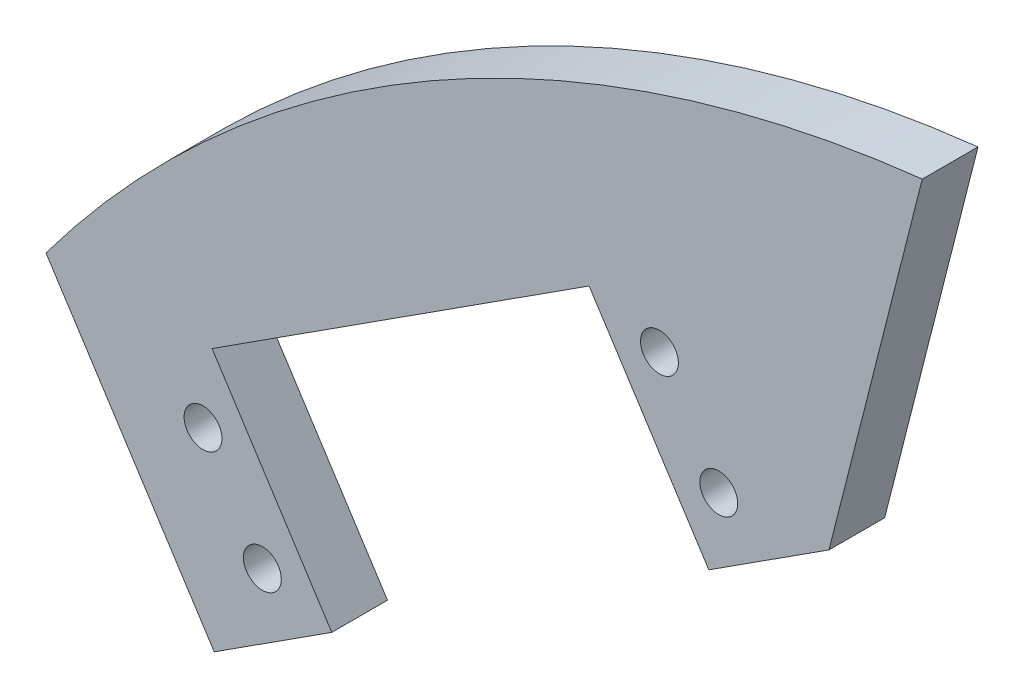
ISO-10303-21;
HEADER;
FILE_DESCRIPTION(('STEP AP214'),'2;1');
FILE_NAME('part.step','',(''),(''),'','','');
FILE_SCHEMA(('AUTOMOTIVE_DESIGN { 1 0 10303 214 1 1 1 1 }'));
ENDSEC;
DATA;
#1=APPLICATION_CONTEXT('core data for automotive mechanical design processes');
#2=APPLICATION_PROTOCOL_DEFINITION('international standard','automotive_design',2000,#1);
#3=PRODUCT_CONTEXT('',#1,'mechanical');
#4=PRODUCT('Part','Part','',(#3));
#5=PRODUCT_RELATED_PRODUCT_CATEGORY('part','',(#4));
#6=PRODUCT_DEFINITION_FORMATION('','',#4);
#7=PRODUCT_DEFINITION_CONTEXT('part definition',#1,'design');
#8=PRODUCT_DEFINITION('design','',#6,#7);
#9=PRODUCT_DEFINITION_SHAPE('','',#8);
#10=(LENGTH_UNIT() NAMED_UNIT(*) SI_UNIT(.MILLI.,.METRE.));
#11=(NAMED_UNIT(*) PLANE_ANGLE_UNIT() SI_UNIT($,.RADIAN.));
#12=(NAMED_UNIT(*) SI_UNIT($,.STERADIAN.) SOLID_ANGLE_UNIT());
#13=UNCERTAINTY_MEASURE_WITH_UNIT(LENGTH_MEASURE(1.E-05),#10,'distance_accuracy_value','');
#14=(GEOMETRIC_REPRESENTATION_CONTEXT(3) GLOBAL_UNCERTAINTY_ASSIGNED_CONTEXT((#13)) GLOBAL_UNIT_ASSIGNED_CONTEXT((#10,
#11,#12)) REPRESENTATION_CONTEXT('',''));
#15=CARTESIAN_POINT('',(0.,0.,0.));
#16=DIRECTION('',(0.,0.,1.));
#17=DIRECTION('',(1.,0.,0.));
#18=AXIS2_PLACEMENT_3D('',#15,#16,#17);
#19=CARTESIAN_POINT('',(0.,0.,5.08));
#20=DIRECTION('',(-0.541224138228905,0.84087836944375,0.));
#21=DIRECTION('',(-0.84087836944375,-0.541224138228905,0.));
#22=AXIS2_PLACEMENT_3D('',#19,#20,#21);
#23=PLANE('',#22);
#24=DIRECTION('',(0.84087836944375,0.541224138228905,0.));
#25=VECTOR('',#24,1.);
#26=CARTESIAN_POINT('',(0.,0.,0.));
#27=LINE('',#26,#25);
#28=CARTESIAN_POINT('',(0.,0.,0.));
#29=VERTEX_POINT('',#28);
#30=CARTESIAN_POINT('',(10.7188199232245,6.89907635466426,0.));
#31=VERTEX_POINT('',#30);
#32=EDGE_CURVE('E142',#29,#31,#27,.T.);
#33=ORIENTED_EDGE('',*,*,#32,.T.);
#34=DIRECTION('',(0.,0.,1.));
#35=VECTOR('',#34,1.);
#36=CARTESIAN_POINT('',(10.7188199232245,6.89907635466426,5.08));
#37=LINE('',#36,#35);
#38=CARTESIAN_POINT('',(10.7188199232245,6.89907635466426,5.08));
#39=VERTEX_POINT('',#38);
#40=EDGE_CURVE('E130',#31,#39,#37,.T.);
#41=ORIENTED_EDGE('',*,*,#40,.T.);
#42=DIRECTION('',(0.84087836944375,0.541224138228905,0.));
#43=VECTOR('',#42,1.);
#44=CARTESIAN_POINT('',(0.,0.,5.08));
#45=LINE('',#44,#43);
#46=CARTESIAN_POINT('',(0.,0.,5.08));
#47=VERTEX_POINT('',#46);
#48=EDGE_CURVE('E134',#47,#39,#45,.T.);
#49=ORIENTED_EDGE('',*,*,#48,.F.);
#50=DIRECTION('',(0.,0.,-1.));
#51=VECTOR('',#50,1.);
#52=CARTESIAN_POINT('',(0.,0.,5.08));
#53=LINE('',#52,#51);
#54=EDGE_CURVE('E141',#47,#29,#53,.T.);
#55=ORIENTED_EDGE('',*,*,#54,.T.);
#56=EDGE_LOOP('',(#33,#41,#49,#55));
#57=FACE_BOUND('',#56,.T.);
#58=ADVANCED_FACE('F33',(#57),#23,.F.);
#59=CARTESIAN_POINT('',(45.1056999632572,29.0318962633971,5.08));
#60=VERTEX_POINT('',#59);
#61=CARTESIAN_POINT('',(56.065565282662,36.0861194164122,5.08));
#62=VERTEX_POINT('',#61);
#63=EDGE_CURVE('E85',#60,#62,#45,.T.);
#64=ORIENTED_EDGE('',*,*,#63,.F.);
#65=DIRECTION('',(0.,0.,-1.));
#66=VECTOR('',#65,1.);
#67=CARTESIAN_POINT('',(45.1056999632572,29.0318962633971,5.08));
#68=LINE('',#67,#66);
#69=CARTESIAN_POINT('',(45.1056999632572,29.0318962633971,0.));
#70=VERTEX_POINT('',#69);
#71=EDGE_CURVE('E108',#60,#70,#68,.T.);
#72=ORIENTED_EDGE('',*,*,#71,.T.);
#73=CARTESIAN_POINT('',(56.065565282662,36.0861194164122,0.));
#74=VERTEX_POINT('',#73);
#75=EDGE_CURVE('E133',#70,#74,#27,.T.);
#76=ORIENTED_EDGE('',*,*,#75,.T.);
#77=DIRECTION('',(0.,0.,-1.));
#78=VECTOR('',#77,1.);
#79=CARTESIAN_POINT('',(56.065565282662,36.0861194164122,5.08));
#80=LINE('',#79,#78);
#81=EDGE_CURVE('E41',#62,#74,#80,.T.);
#82=ORIENTED_EDGE('',*,*,#81,.F.);
#83=EDGE_LOOP('',(#64,#72,#76,#82));
#84=FACE_BOUND('',#83,.T.);
#85=ADVANCED_FACE('F35',(#84),#23,.F.);
#86=CARTESIAN_POINT('',(56.065565282662,36.0861194164122,5.08));
#87=DIRECTION('',(-0.969303945872021,0.245865533405824,0.));
#88=DIRECTION('',(-0.245865533405824,-0.969303945872021,0.));
#89=AXIS2_PLACEMENT_3D('',#86,#87,#88);
#90=PLANE('',#89);
#91=DIRECTION('',(0.245865533405824,0.969303945872021,0.));
#92=VECTOR('',#91,1.);
#93=CARTESIAN_POINT('',(56.065565282662,36.0861194164122,0.));
#94=LINE('',#93,#92);
#95=CARTESIAN_POINT('',(64.5737650869772,69.6289732208849,0.));
#96=VERTEX_POINT('',#95);
#97=EDGE_CURVE('E145',#74,#96,#94,.T.);
#98=ORIENTED_EDGE('',*,*,#97,.T.);
#99=DIRECTION('',(0.,0.,-1.));
#100=VECTOR('',#99,1.);
#101=CARTESIAN_POINT('',(64.5737650869772,69.6289732208849,5.08));
#102=LINE('',#101,#100);
#103=CARTESIAN_POINT('',(64.5737650869772,69.6289732208849,5.08));
#104=VERTEX_POINT('',#103);
#105=EDGE_CURVE('E153',#104,#96,#102,.T.);
#106=ORIENTED_EDGE('',*,*,#105,.F.);
#107=DIRECTION('',(0.245865533405824,0.969303945872021,0.));
#108=VECTOR('',#107,1.);
#109=CARTESIAN_POINT('',(56.065565282662,36.0861194164122,5.08));
#110=LINE('',#109,#108);
#111=EDGE_CURVE('E136',#62,#104,#110,.T.);
#112=ORIENTED_EDGE('',*,*,#111,.F.);
#113=ORIENTED_EDGE('',*,*,#81,.T.);
#114=EDGE_LOOP('',(#98,#106,#112,#113));
#115=FACE_BOUND('',#114,.T.);
#116=ADVANCED_FACE('F158',(#115),#90,.F.);
#117=CARTESIAN_POINT('',(77.2788563803177,-45.1795211339497,5.08));
#118=DIRECTION('',(0.,0.,-1.));
#119=DIRECTION('',(-1.,0.,0.));
#120=AXIS2_PLACEMENT_3D('',#117,#118,#119);
#121=CYLINDRICAL_SURFACE('',#120,115.5093490623);
#122=CARTESIAN_POINT('',(77.2788563803177,-45.1795211339497,0.));
#123=DIRECTION('',(0.,0.,1.));
#124=DIRECTION('',(1.,0.,0.));
#125=AXIS2_PLACEMENT_3D('',#122,#123,#124);
#126=CIRCLE('',#125,115.5093490623);
#127=CARTESIAN_POINT('',(-15.3435248614539,23.8386229580216,0.));
#128=VERTEX_POINT('',#127);
#129=EDGE_CURVE('E147',#96,#128,#126,.T.);
#130=ORIENTED_EDGE('',*,*,#129,.T.);
#131=DIRECTION('',(0.,0.,-1.));
#132=VECTOR('',#131,1.);
#133=CARTESIAN_POINT('',(-15.3435248614539,23.8386229580216,5.08));
#134=LINE('',#133,#132);
#135=CARTESIAN_POINT('',(-15.3435248614539,23.8386229580216,5.08));
#136=VERTEX_POINT('',#135);
#137=EDGE_CURVE('E151',#136,#128,#134,.T.);
#138=ORIENTED_EDGE('',*,*,#137,.F.);
#139=CARTESIAN_POINT('',(77.2788563803177,-45.1795211339497,5.08));
#140=DIRECTION('',(0.,0.,1.));
#141=DIRECTION('',(1.,0.,0.));
#142=AXIS2_PLACEMENT_3D('',#139,#140,#141);
#143=CIRCLE('',#142,115.5093490623);
#144=EDGE_CURVE('E138',#104,#136,#143,.T.);
#145=ORIENTED_EDGE('',*,*,#144,.F.);
#146=ORIENTED_EDGE('',*,*,#105,.T.);
#147=EDGE_LOOP('',(#130,#138,#145,#146));
#148=FACE_BOUND('',#147,.T.);
#149=ADVANCED_FACE('F169',(#148),#121,.T.);
#150=CARTESIAN_POINT('',(-15.3435248614539,23.8386229580216,5.08));
#151=DIRECTION('',(0.840878369443749,0.541224138228905,0.));
#152=DIRECTION('',(-0.541224138228905,0.84087836944375,0.));
#153=AXIS2_PLACEMENT_3D('',#150,#151,#152);
#154=PLANE('',#153);
#155=DIRECTION('',(0.541224138228905,-0.84087836944375,0.));
#156=VECTOR('',#155,1.);
#157=CARTESIAN_POINT('',(-15.3435248614539,23.8386229580216,0.));
#158=LINE('',#157,#156);
#159=EDGE_CURVE('E78',#128,#29,#158,.T.);
#160=ORIENTED_EDGE('',*,*,#159,.T.);
#161=ORIENTED_EDGE('',*,*,#54,.F.);
#162=DIRECTION('',(0.541224138228905,-0.84087836944375,0.));
#163=VECTOR('',#162,1.);
#164=CARTESIAN_POINT('',(-15.3435248614539,23.8386229580216,5.08));
#165=LINE('',#164,#163);
#166=EDGE_CURVE('E57',#136,#47,#165,.T.);
#167=ORIENTED_EDGE('',*,*,#166,.F.);
#168=ORIENTED_EDGE('',*,*,#137,.T.);
#169=EDGE_LOOP('',(#160,#161,#167,#168));
#170=FACE_BOUND('',#169,.T.);
#171=ADVANCED_FACE('F171',(#170),#154,.F.);
#172=CARTESIAN_POINT('',(77.2788563803177,-45.1795211339497,5.08));
#173=DIRECTION('',(0.,0.,1.));
#174=DIRECTION('',(1.,0.,0.));
#175=AXIS2_PLACEMENT_3D('',#172,#173,#174);
#176=PLANE('',#175);
#177=CARTESIAN_POINT('',(46.0123874549428,35.5737074102218,5.08));
#178=DIRECTION('',(0.,0.,1.));
#179=DIRECTION('',(1.,0.,0.));
#180=AXIS2_PLACEMENT_3D('',#177,#178,#179);
#181=CIRCLE('',#180,1.72720000000001);
#182=CARTESIAN_POINT('',(47.7395874549428,35.5737074102218,5.08));
#183=VERTEX_POINT('',#182);
#184=EDGE_CURVE('E181',#183,#183,#181,.T.);
#185=ORIENTED_EDGE('',*,*,#184,.F.);
#186=EDGE_LOOP('',(#185));
#187=FACE_BOUND('',#186,.T.);
#188=CARTESIAN_POINT('',(-1.02333321481187,17.1918962623283,5.08));
#189=DIRECTION('',(0.,0.,1.));
#190=DIRECTION('',(1.,0.,0.));
#191=AXIS2_PLACEMENT_3D('',#188,#189,#190);
#192=CIRCLE('',#191,1.7272);
#193=CARTESIAN_POINT('',(0.70386678518813,17.1918962623283,5.08));
#194=VERTEX_POINT('',#193);
#195=EDGE_CURVE('E190',#194,#194,#192,.T.);
#196=ORIENTED_EDGE('',*,*,#195,.F.);
#197=EDGE_LOOP('',(#196));
#198=FACE_BOUND('',#197,.T.);
#199=CARTESIAN_POINT('',(4.38890816747716,8.78311256789089,5.08));
#200=DIRECTION('',(0.,0.,1.));
#201=DIRECTION('',(1.,0.,0.));
#202=AXIS2_PLACEMENT_3D('',#199,#200,#201);
#203=CIRCLE('',#202,1.72720000000001);
#204=CARTESIAN_POINT('',(6.11610816747717,8.78311256789089,5.08));
#205=VERTEX_POINT('',#204);
#206=EDGE_CURVE('E210',#205,#205,#203,.T.);
#207=ORIENTED_EDGE('',*,*,#206,.F.);
#208=EDGE_LOOP('',(#207));
#209=FACE_BOUND('',#208,.T.);
#210=CARTESIAN_POINT('',(40.6001460726538,43.9824911046592,5.08));
#211=DIRECTION('',(0.,0.,1.));
#212=DIRECTION('',(1.,0.,0.));
#213=AXIS2_PLACEMENT_3D('',#210,#211,#212);
#214=CIRCLE('',#213,1.72719999999991);
#215=CARTESIAN_POINT('',(42.3273460726537,43.9824911046592,5.08));
#216=VERTEX_POINT('',#215);
#217=EDGE_CURVE('E211',#216,#216,#214,.T.);
#218=ORIENTED_EDGE('',*,*,#217,.F.);
#219=EDGE_LOOP('',(#218));
#220=FACE_BOUND('',#219,.T.);
#221=DIRECTION('',(0.541224138228905,-0.84087836944375,0.));
#222=VECTOR('',#221,1.);
#223=CARTESIAN_POINT('',(10.7999243444548,6.77306764836013,5.08));
#224=LINE('',#223,#222);
#225=CARTESIAN_POINT('',(-0.197750144356549,23.8597161154571,5.08));
#226=VERTEX_POINT('',#225);
#227=EDGE_CURVE('E111',#226,#39,#224,.T.);
#228=ORIENTED_EDGE('',*,*,#227,.F.);
#229=DIRECTION('',(-0.84087836944375,-0.541224138228904,0.));
#230=VECTOR('',#229,1.);
#231=CARTESIAN_POINT('',(-0.197750144356549,23.8597161154571,5.08));
#232=LINE('',#231,#230);
#233=CARTESIAN_POINT('',(34.1891298956762,45.99253602419,5.08));
#234=VERTEX_POINT('',#233);
#235=EDGE_CURVE('E110',#234,#226,#232,.T.);
#236=ORIENTED_EDGE('',*,*,#235,.F.);
#237=DIRECTION('',(-0.541224138228905,0.84087836944375,0.));
#238=VECTOR('',#237,1.);
#239=CARTESIAN_POINT('',(45.1868043844875,28.905887557093,5.08));
#240=LINE('',#239,#238);
#241=EDGE_CURVE('E105',#60,#234,#240,.T.);
#242=ORIENTED_EDGE('',*,*,#241,.F.);
#243=ORIENTED_EDGE('',*,*,#63,.T.);
#244=ORIENTED_EDGE('',*,*,#111,.T.);
#245=ORIENTED_EDGE('',*,*,#144,.T.);
#246=ORIENTED_EDGE('',*,*,#166,.T.);
#247=ORIENTED_EDGE('',*,*,#48,.T.);
#248=EDGE_LOOP('',(#228,#236,#242,#243,#244,#245,#246,#247));
#249=FACE_BOUND('',#248,.T.);
#250=ADVANCED_FACE('F123',(#187,#198,#209,#220,#249),#176,.T.);
#251=CARTESIAN_POINT('',(77.2788563803177,-45.1795211339497,0.));
#252=DIRECTION('',(0.,0.,1.));
#253=DIRECTION('',(1.,0.,0.));
#254=AXIS2_PLACEMENT_3D('',#251,#252,#253);
#255=PLANE('',#254);
#256=CARTESIAN_POINT('',(46.0123874549428,35.5737074102218,0.));
#257=DIRECTION('',(0.,0.,1.));
#258=DIRECTION('',(1.,0.,0.));
#259=AXIS2_PLACEMENT_3D('',#256,#257,#258);
#260=CIRCLE('',#259,1.72720000000001);
#261=CARTESIAN_POINT('',(47.7395874549428,35.5737074102218,0.));
#262=VERTEX_POINT('',#261);
#263=EDGE_CURVE('E179',#262,#262,#260,.F.);
#264=ORIENTED_EDGE('',*,*,#263,.F.);
#265=EDGE_LOOP('',(#264));
#266=FACE_BOUND('',#265,.T.);
#267=CARTESIAN_POINT('',(-1.02333321481187,17.1918962623283,0.));
#268=DIRECTION('',(0.,0.,1.));
#269=DIRECTION('',(1.,0.,0.));
#270=AXIS2_PLACEMENT_3D('',#267,#268,#269);
#271=CIRCLE('',#270,1.7272);
#272=CARTESIAN_POINT('',(0.70386678518813,17.1918962623283,0.));
#273=VERTEX_POINT('',#272);
#274=EDGE_CURVE('E186',#273,#273,#271,.F.);
#275=ORIENTED_EDGE('',*,*,#274,.F.);
#276=EDGE_LOOP('',(#275));
#277=FACE_BOUND('',#276,.T.);
#278=CARTESIAN_POINT('',(4.38890816747716,8.78311256789089,0.));
#279=DIRECTION('',(0.,0.,1.));
#280=DIRECTION('',(1.,0.,0.));
#281=AXIS2_PLACEMENT_3D('',#278,#279,#280);
#282=CIRCLE('',#281,1.72720000000001);
#283=CARTESIAN_POINT('',(6.11610816747717,8.78311256789089,0.));
#284=VERTEX_POINT('',#283);
#285=EDGE_CURVE('E192',#284,#284,#282,.F.);
#286=ORIENTED_EDGE('',*,*,#285,.F.);
#287=EDGE_LOOP('',(#286));
#288=FACE_BOUND('',#287,.T.);
#289=CARTESIAN_POINT('',(40.6001460726538,43.9824911046592,0.));
#290=DIRECTION('',(0.,0.,1.));
#291=DIRECTION('',(1.,0.,0.));
#292=AXIS2_PLACEMENT_3D('',#289,#290,#291);
#293=CIRCLE('',#292,1.72719999999991);
#294=CARTESIAN_POINT('',(42.3273460726537,43.9824911046592,0.));
#295=VERTEX_POINT('',#294);
#296=EDGE_CURVE('E208',#295,#295,#293,.F.);
#297=ORIENTED_EDGE('',*,*,#296,.F.);
#298=EDGE_LOOP('',(#297));
#299=FACE_BOUND('',#298,.T.);
#300=DIRECTION('',(0.84087836944375,0.541224138228904,0.));
#301=VECTOR('',#300,1.);
#302=CARTESIAN_POINT('',(-0.197750144356549,23.8597161154571,0.));
#303=LINE('',#302,#301);
#304=CARTESIAN_POINT('',(-0.197750144356549,23.8597161154571,0.));
#305=VERTEX_POINT('',#304);
#306=CARTESIAN_POINT('',(34.1891298956762,45.99253602419,0.));
#307=VERTEX_POINT('',#306);
#308=EDGE_CURVE('E119',#305,#307,#303,.T.);
#309=ORIENTED_EDGE('',*,*,#308,.F.);
#310=DIRECTION('',(0.541224138228905,-0.84087836944375,0.));
#311=VECTOR('',#310,1.);
#312=CARTESIAN_POINT('',(53.9169841654216,-60.2161894755139,0.));
#313=LINE('',#312,#311);
#314=EDGE_CURVE('E11',#305,#31,#313,.T.);
#315=ORIENTED_EDGE('',*,*,#314,.T.);
#316=ORIENTED_EDGE('',*,*,#32,.F.);
#317=ORIENTED_EDGE('',*,*,#159,.F.);
#318=ORIENTED_EDGE('',*,*,#129,.F.);
#319=ORIENTED_EDGE('',*,*,#97,.F.);
#320=ORIENTED_EDGE('',*,*,#75,.F.);
#321=DIRECTION('',(0.541224138228905,-0.84087836944375,0.));
#322=VECTOR('',#321,1.);
#323=CARTESIAN_POINT('',(45.1868043844875,28.905887557093,0.));
#324=LINE('',#323,#322);
#325=EDGE_CURVE('E127',#307,#70,#324,.T.);
#326=ORIENTED_EDGE('',*,*,#325,.F.);
#327=EDGE_LOOP('',(#309,#315,#316,#317,#318,#319,#320,#326));
#328=FACE_BOUND('',#327,.T.);
#329=ADVANCED_FACE('F165',(#266,#277,#288,#299,#328),#255,.F.);
#330=CARTESIAN_POINT('',(10.7999243444548,6.77306764836013,-59.9827015852432));
#331=DIRECTION('',(-0.84087836944375,-0.541224138228905,0.));
#332=DIRECTION('',(0.541224138228905,-0.84087836944375,0.));
#333=AXIS2_PLACEMENT_3D('',#330,#331,#332);
#334=PLANE('',#333);
#335=ORIENTED_EDGE('',*,*,#314,.F.);
#336=DIRECTION('',(0.,0.,1.));
#337=VECTOR('',#336,1.);
#338=CARTESIAN_POINT('',(-0.197750144356549,23.8597161154571,-59.9827015852432));
#339=LINE('',#338,#337);
#340=EDGE_CURVE('E121',#305,#226,#339,.T.);
#341=ORIENTED_EDGE('',*,*,#340,.T.);
#342=ORIENTED_EDGE('',*,*,#227,.T.);
#343=ORIENTED_EDGE('',*,*,#40,.F.);
#344=EDGE_LOOP('',(#335,#341,#342,#343));
#345=FACE_BOUND('',#344,.T.);
#346=ADVANCED_FACE('F175',(#345),#334,.F.);
#347=CARTESIAN_POINT('',(45.1868043844875,28.905887557093,-59.9827015852432));
#348=DIRECTION('',(0.84087836944375,0.541224138228905,0.));
#349=DIRECTION('',(-0.541224138228905,0.84087836944375,0.));
#350=AXIS2_PLACEMENT_3D('',#347,#348,#349);
#351=PLANE('',#350);
#352=ORIENTED_EDGE('',*,*,#241,.T.);
#353=DIRECTION('',(0.,0.,1.));
#354=VECTOR('',#353,1.);
#355=CARTESIAN_POINT('',(34.1891298956762,45.99253602419,-59.9827015852432));
#356=LINE('',#355,#354);
#357=EDGE_CURVE('E48',#307,#234,#356,.T.);
#358=ORIENTED_EDGE('',*,*,#357,.F.);
#359=ORIENTED_EDGE('',*,*,#325,.T.);
#360=ORIENTED_EDGE('',*,*,#71,.F.);
#361=EDGE_LOOP('',(#352,#358,#359,#360));
#362=FACE_BOUND('',#361,.T.);
#363=ADVANCED_FACE('F106',(#362),#351,.F.);
#364=CARTESIAN_POINT('',(-0.197750144356549,23.8597161154571,-59.9827015852432));
#365=DIRECTION('',(-0.541224138228904,0.84087836944375,0.));
#366=DIRECTION('',(-0.84087836944375,-0.541224138228904,0.));
#367=AXIS2_PLACEMENT_3D('',#364,#365,#366);
#368=PLANE('',#367);
#369=ORIENTED_EDGE('',*,*,#308,.T.);
#370=ORIENTED_EDGE('',*,*,#357,.T.);
#371=ORIENTED_EDGE('',*,*,#235,.T.);
#372=ORIENTED_EDGE('',*,*,#340,.F.);
#373=EDGE_LOOP('',(#369,#370,#371,#372));
#374=FACE_BOUND('',#373,.T.);
#375=ADVANCED_FACE('F115',(#374),#368,.F.);
#376=CARTESIAN_POINT('',(40.6001460726538,43.9824911046592,-59.9827015852432));
#377=DIRECTION('',(0.,0.,1.));
#378=DIRECTION('',(1.,0.,0.));
#379=AXIS2_PLACEMENT_3D('',#376,#377,#378);
#380=CYLINDRICAL_SURFACE('',#379,1.72719999999991);
#381=ORIENTED_EDGE('',*,*,#296,.T.);
#382=EDGE_LOOP('',(#381));
#383=FACE_BOUND('',#382,.T.);
#384=ORIENTED_EDGE('',*,*,#217,.T.);
#385=EDGE_LOOP('',(#384));
#386=FACE_BOUND('',#385,.T.);
#387=ADVANCED_FACE('F221',(#383,#386),#380,.F.);
#388=CARTESIAN_POINT('',(4.38890816747716,8.78311256789089,-59.9827015852432));
#389=DIRECTION('',(0.,0.,1.));
#390=DIRECTION('',(1.,0.,0.));
#391=AXIS2_PLACEMENT_3D('',#388,#389,#390);
#392=CYLINDRICAL_SURFACE('',#391,1.72720000000001);
#393=ORIENTED_EDGE('',*,*,#285,.T.);
#394=EDGE_LOOP('',(#393));
#395=FACE_BOUND('',#394,.T.);
#396=ORIENTED_EDGE('',*,*,#206,.T.);
#397=EDGE_LOOP('',(#396));
#398=FACE_BOUND('',#397,.T.);
#399=ADVANCED_FACE('F218',(#395,#398),#392,.F.);
#400=CARTESIAN_POINT('',(-1.02333321481187,17.1918962623283,-59.9827015852432));
#401=DIRECTION('',(0.,0.,1.));
#402=DIRECTION('',(1.,0.,0.));
#403=AXIS2_PLACEMENT_3D('',#400,#401,#402);
#404=CYLINDRICAL_SURFACE('',#403,1.7272);
#405=ORIENTED_EDGE('',*,*,#274,.T.);
#406=EDGE_LOOP('',(#405));
#407=FACE_BOUND('',#406,.T.);
#408=ORIENTED_EDGE('',*,*,#195,.T.);
#409=EDGE_LOOP('',(#408));
#410=FACE_BOUND('',#409,.T.);
#411=ADVANCED_FACE('F196',(#407,#410),#404,.F.);
#412=CARTESIAN_POINT('',(46.0123874549428,35.5737074102218,-59.9827015852432));
#413=DIRECTION('',(0.,0.,1.));
#414=DIRECTION('',(1.,0.,0.));
#415=AXIS2_PLACEMENT_3D('',#412,#413,#414);
#416=CYLINDRICAL_SURFACE('',#415,1.72720000000001);
#417=ORIENTED_EDGE('',*,*,#263,.T.);
#418=EDGE_LOOP('',(#417));
#419=FACE_BOUND('',#418,.T.);
#420=ORIENTED_EDGE('',*,*,#184,.T.);
#421=EDGE_LOOP('',(#420));
#422=FACE_BOUND('',#421,.T.);
#423=ADVANCED_FACE('F257',(#419,#422),#416,.F.);
#424=CLOSED_SHELL('',(#58,#85,#116,#149,#171,#250,#329,#346,#363,#375,#387,#399,#411,#423));
#425=MANIFOLD_SOLID_BREP('B2',#424);
#426=ADVANCED_BREP_SHAPE_REPRESENTATION('',(#18,#425),#14);
#427=SHAPE_DEFINITION_REPRESENTATION(#9,#426);
ENDSEC;
END-ISO-10303-21;
